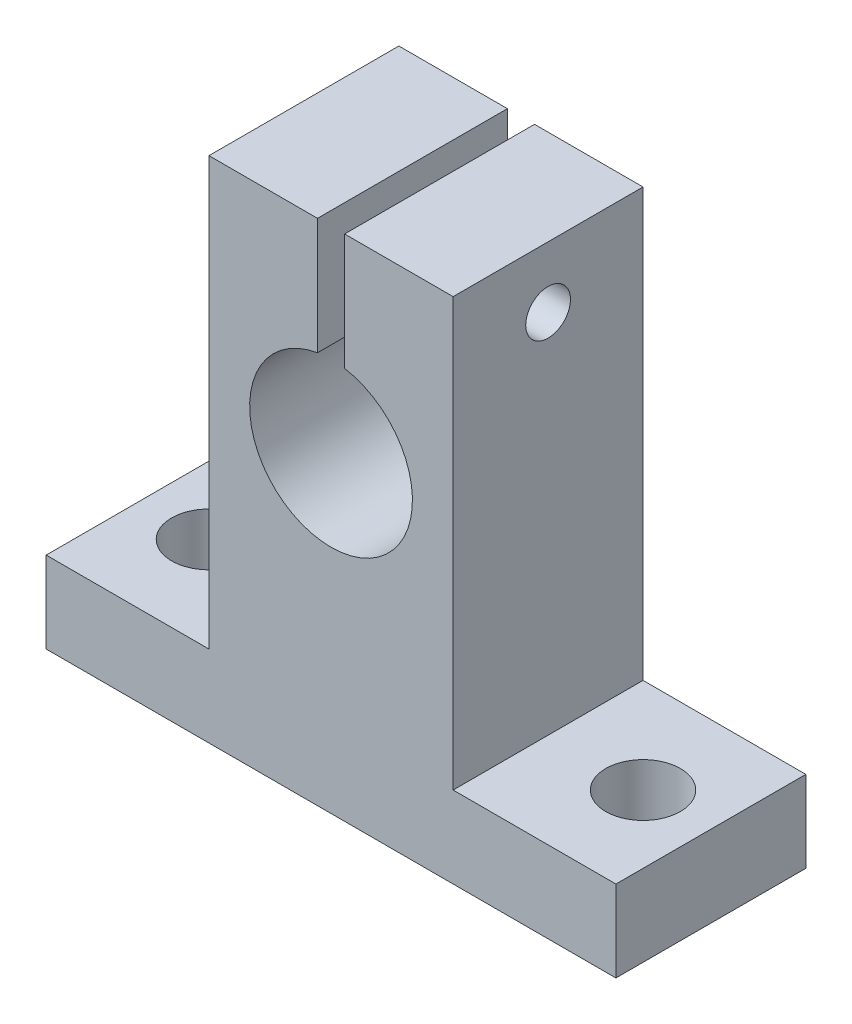
ISO-10303-21;
HEADER;
FILE_DESCRIPTION(('STEP AP214'),'2;1');
FILE_NAME('part.step','',(''),(''),'','','');
FILE_SCHEMA(('AUTOMOTIVE_DESIGN { 1 0 10303 214 1 1 1 1 }'));
ENDSEC;
DATA;
#1=APPLICATION_CONTEXT('core data for automotive mechanical design processes');
#2=APPLICATION_PROTOCOL_DEFINITION('international standard','automotive_design',2000,#1);
#3=PRODUCT_CONTEXT('',#1,'mechanical');
#4=PRODUCT('Part','Part','',(#3));
#5=PRODUCT_RELATED_PRODUCT_CATEGORY('part','',(#4));
#6=PRODUCT_DEFINITION_FORMATION('','',#4);
#7=PRODUCT_DEFINITION_CONTEXT('part definition',#1,'design');
#8=PRODUCT_DEFINITION('design','',#6,#7);
#9=PRODUCT_DEFINITION_SHAPE('','',#8);
#10=(LENGTH_UNIT() NAMED_UNIT(*) SI_UNIT(.MILLI.,.METRE.));
#11=(NAMED_UNIT(*) PLANE_ANGLE_UNIT() SI_UNIT($,.RADIAN.));
#12=(NAMED_UNIT(*) SI_UNIT($,.STERADIAN.) SOLID_ANGLE_UNIT());
#13=UNCERTAINTY_MEASURE_WITH_UNIT(LENGTH_MEASURE(1.E-05),#10,'distance_accuracy_value','');
#14=(GEOMETRIC_REPRESENTATION_CONTEXT(3) GLOBAL_UNCERTAINTY_ASSIGNED_CONTEXT((#13)) GLOBAL_UNIT_ASSIGNED_CONTEXT((#10,
#11,#12)) REPRESENTATION_CONTEXT('',''));
#15=CARTESIAN_POINT('',(0.,0.,0.));
#16=DIRECTION('',(0.,0.,1.));
#17=DIRECTION('',(1.,0.,0.));
#18=AXIS2_PLACEMENT_3D('',#15,#16,#17);
#19=CARTESIAN_POINT('',(0.,0.,14.));
#20=DIRECTION('',(0.,0.,1.));
#21=DIRECTION('',(1.,0.,0.));
#22=AXIS2_PLACEMENT_3D('',#19,#20,#21);
#23=PLANE('',#22);
#24=DIRECTION('',(0.,1.,0.));
#25=VECTOR('',#24,1.);
#26=CARTESIAN_POINT('',(1.,0.,14.));
#27=LINE('',#26,#25);
#28=CARTESIAN_POINT('',(1.,5.91607978309962,14.));
#29=VERTEX_POINT('',#28);
#30=CARTESIAN_POINT('',(1.,14.5,14.));
#31=VERTEX_POINT('',#30);
#32=EDGE_CURVE('E179',#29,#31,#27,.T.);
#33=ORIENTED_EDGE('',*,*,#32,.F.);
#34=CARTESIAN_POINT('',(0.,0.,14.));
#35=DIRECTION('',(0.,0.,-1.));
#36=DIRECTION('',(-1.,0.,0.));
#37=AXIS2_PLACEMENT_3D('',#34,#35,#36);
#38=CIRCLE('',#37,6.);
#39=CARTESIAN_POINT('',(-1.,5.91607978309961,14.));
#40=VERTEX_POINT('',#39);
#41=EDGE_CURVE('E52',#29,#40,#38,.T.);
#42=ORIENTED_EDGE('',*,*,#41,.T.);
#43=DIRECTION('',(0.,1.,0.));
#44=VECTOR('',#43,1.);
#45=CARTESIAN_POINT('',(-1.,0.,14.));
#46=LINE('',#45,#44);
#47=CARTESIAN_POINT('',(-1.,14.5,14.));
#48=VERTEX_POINT('',#47);
#49=EDGE_CURVE('E92',#40,#48,#46,.T.);
#50=ORIENTED_EDGE('',*,*,#49,.T.);
#51=DIRECTION('',(-1.,0.,0.));
#52=VECTOR('',#51,1.);
#53=CARTESIAN_POINT('',(-1.,14.5,14.));
#54=LINE('',#53,#52);
#55=CARTESIAN_POINT('',(-9.,14.5,14.));
#56=VERTEX_POINT('',#55);
#57=EDGE_CURVE('E107',#48,#56,#54,.T.);
#58=ORIENTED_EDGE('',*,*,#57,.T.);
#59=DIRECTION('',(0.,-1.,0.));
#60=VECTOR('',#59,1.);
#61=CARTESIAN_POINT('',(-9.,14.5,14.));
#62=LINE('',#61,#60);
#63=CARTESIAN_POINT('',(-8.99999999999999,-17.,14.));
#64=VERTEX_POINT('',#63);
#65=EDGE_CURVE('E100',#56,#64,#62,.T.);
#66=ORIENTED_EDGE('',*,*,#65,.T.);
#67=DIRECTION('',(-1.,0.,0.));
#68=VECTOR('',#67,1.);
#69=CARTESIAN_POINT('',(-8.99999999999999,-17.,14.));
#70=LINE('',#69,#68);
#71=CARTESIAN_POINT('',(-21.,-17.,14.));
#72=VERTEX_POINT('',#71);
#73=EDGE_CURVE('E104',#64,#72,#70,.T.);
#74=ORIENTED_EDGE('',*,*,#73,.T.);
#75=DIRECTION('',(0.,-1.,0.));
#76=VECTOR('',#75,1.);
#77=CARTESIAN_POINT('',(-21.,-17.,14.));
#78=LINE('',#77,#76);
#79=CARTESIAN_POINT('',(-21.,-23.,14.));
#80=VERTEX_POINT('',#79);
#81=EDGE_CURVE('E61',#72,#80,#78,.T.);
#82=ORIENTED_EDGE('',*,*,#81,.T.);
#83=DIRECTION('',(1.,0.,0.));
#84=VECTOR('',#83,1.);
#85=CARTESIAN_POINT('',(-21.,-23.,14.));
#86=LINE('',#85,#84);
#87=CARTESIAN_POINT('',(21.,-23.,14.));
#88=VERTEX_POINT('',#87);
#89=EDGE_CURVE('E140',#80,#88,#86,.T.);
#90=ORIENTED_EDGE('',*,*,#89,.T.);
#91=DIRECTION('',(0.,-1.,0.));
#92=VECTOR('',#91,1.);
#93=CARTESIAN_POINT('',(21.,-17.,14.));
#94=LINE('',#93,#92);
#95=CARTESIAN_POINT('',(21.,-17.,14.));
#96=VERTEX_POINT('',#95);
#97=EDGE_CURVE('E166',#96,#88,#94,.T.);
#98=ORIENTED_EDGE('',*,*,#97,.F.);
#99=DIRECTION('',(1.,0.,0.));
#100=VECTOR('',#99,1.);
#101=CARTESIAN_POINT('',(8.99999999999999,-17.,14.));
#102=LINE('',#101,#100);
#103=CARTESIAN_POINT('',(8.99999999999999,-17.,14.));
#104=VERTEX_POINT('',#103);
#105=EDGE_CURVE('E169',#104,#96,#102,.T.);
#106=ORIENTED_EDGE('',*,*,#105,.F.);
#107=DIRECTION('',(0.,-1.,0.));
#108=VECTOR('',#107,1.);
#109=CARTESIAN_POINT('',(9.,14.5,14.));
#110=LINE('',#109,#108);
#111=CARTESIAN_POINT('',(9.,14.5,14.));
#112=VERTEX_POINT('',#111);
#113=EDGE_CURVE('E173',#112,#104,#110,.T.);
#114=ORIENTED_EDGE('',*,*,#113,.F.);
#115=DIRECTION('',(1.,0.,0.));
#116=VECTOR('',#115,1.);
#117=CARTESIAN_POINT('',(1.,14.5,14.));
#118=LINE('',#117,#116);
#119=EDGE_CURVE('E176',#31,#112,#118,.T.);
#120=ORIENTED_EDGE('',*,*,#119,.F.);
#121=EDGE_LOOP('',(#33,#42,#50,#58,#66,#74,#82,#90,#98,#106,#114,#120));
#122=FACE_BOUND('',#121,.T.);
#123=ADVANCED_FACE('F38',(#122),#23,.T.);
#124=CARTESIAN_POINT('',(0.,0.,0.));
#125=DIRECTION('',(0.,0.,1.));
#126=DIRECTION('',(1.,0.,0.));
#127=AXIS2_PLACEMENT_3D('',#124,#125,#126);
#128=PLANE('',#127);
#129=CARTESIAN_POINT('',(0.,0.,0.));
#130=DIRECTION('',(0.,0.,-1.));
#131=DIRECTION('',(-1.,0.,0.));
#132=AXIS2_PLACEMENT_3D('',#129,#130,#131);
#133=CIRCLE('',#132,6.);
#134=CARTESIAN_POINT('',(1.,5.91607978309962,0.));
#135=VERTEX_POINT('',#134);
#136=CARTESIAN_POINT('',(-1.,5.91607978309962,0.));
#137=VERTEX_POINT('',#136);
#138=EDGE_CURVE('E248',#135,#137,#133,.T.);
#139=ORIENTED_EDGE('',*,*,#138,.F.);
#140=DIRECTION('',(0.,1.,0.));
#141=VECTOR('',#140,1.);
#142=CARTESIAN_POINT('',(1.,0.,0.));
#143=LINE('',#142,#141);
#144=CARTESIAN_POINT('',(1.,14.5,0.));
#145=VERTEX_POINT('',#144);
#146=EDGE_CURVE('E170',#135,#145,#143,.T.);
#147=ORIENTED_EDGE('',*,*,#146,.T.);
#148=DIRECTION('',(1.,0.,0.));
#149=VECTOR('',#148,1.);
#150=CARTESIAN_POINT('',(1.,14.5,0.));
#151=LINE('',#150,#149);
#152=CARTESIAN_POINT('',(9.,14.5,0.));
#153=VERTEX_POINT('',#152);
#154=EDGE_CURVE('E191',#145,#153,#151,.T.);
#155=ORIENTED_EDGE('',*,*,#154,.T.);
#156=DIRECTION('',(0.,-1.,0.));
#157=VECTOR('',#156,1.);
#158=CARTESIAN_POINT('',(9.,14.5,0.));
#159=LINE('',#158,#157);
#160=CARTESIAN_POINT('',(8.99999999999999,-17.,0.));
#161=VERTEX_POINT('',#160);
#162=EDGE_CURVE('E188',#153,#161,#159,.T.);
#163=ORIENTED_EDGE('',*,*,#162,.T.);
#164=DIRECTION('',(1.,0.,0.));
#165=VECTOR('',#164,1.);
#166=CARTESIAN_POINT('',(8.99999999999999,-17.,0.));
#167=LINE('',#166,#165);
#168=CARTESIAN_POINT('',(21.,-17.,0.));
#169=VERTEX_POINT('',#168);
#170=EDGE_CURVE('E185',#161,#169,#167,.T.);
#171=ORIENTED_EDGE('',*,*,#170,.T.);
#172=DIRECTION('',(0.,-1.,0.));
#173=VECTOR('',#172,1.);
#174=CARTESIAN_POINT('',(21.,-17.,0.));
#175=LINE('',#174,#173);
#176=CARTESIAN_POINT('',(21.,-23.,0.));
#177=VERTEX_POINT('',#176);
#178=EDGE_CURVE('E165',#169,#177,#175,.T.);
#179=ORIENTED_EDGE('',*,*,#178,.T.);
#180=DIRECTION('',(1.,0.,0.));
#181=VECTOR('',#180,1.);
#182=CARTESIAN_POINT('',(-21.,-23.,0.));
#183=LINE('',#182,#181);
#184=CARTESIAN_POINT('',(-21.,-23.,0.));
#185=VERTEX_POINT('',#184);
#186=EDGE_CURVE('E128',#185,#177,#183,.T.);
#187=ORIENTED_EDGE('',*,*,#186,.F.);
#188=DIRECTION('',(0.,-1.,0.));
#189=VECTOR('',#188,1.);
#190=CARTESIAN_POINT('',(-21.,-17.,0.));
#191=LINE('',#190,#189);
#192=CARTESIAN_POINT('',(-21.,-17.,0.));
#193=VERTEX_POINT('',#192);
#194=EDGE_CURVE('E85',#193,#185,#191,.T.);
#195=ORIENTED_EDGE('',*,*,#194,.F.);
#196=DIRECTION('',(-1.,0.,0.));
#197=VECTOR('',#196,1.);
#198=CARTESIAN_POINT('',(-8.99999999999999,-17.,0.));
#199=LINE('',#198,#197);
#200=CARTESIAN_POINT('',(-8.99999999999999,-17.,0.));
#201=VERTEX_POINT('',#200);
#202=EDGE_CURVE('E137',#201,#193,#199,.T.);
#203=ORIENTED_EDGE('',*,*,#202,.F.);
#204=DIRECTION('',(0.,-1.,0.));
#205=VECTOR('',#204,1.);
#206=CARTESIAN_POINT('',(-9.,14.5,0.));
#207=LINE('',#206,#205);
#208=CARTESIAN_POINT('',(-9.,14.5,0.));
#209=VERTEX_POINT('',#208);
#210=EDGE_CURVE('E116',#209,#201,#207,.T.);
#211=ORIENTED_EDGE('',*,*,#210,.F.);
#212=DIRECTION('',(-1.,0.,0.));
#213=VECTOR('',#212,1.);
#214=CARTESIAN_POINT('',(-1.,14.5,0.));
#215=LINE('',#214,#213);
#216=CARTESIAN_POINT('',(-1.,14.5,0.));
#217=VERTEX_POINT('',#216);
#218=EDGE_CURVE('E134',#217,#209,#215,.T.);
#219=ORIENTED_EDGE('',*,*,#218,.F.);
#220=DIRECTION('',(0.,1.,0.));
#221=VECTOR('',#220,1.);
#222=CARTESIAN_POINT('',(-1.,0.,0.));
#223=LINE('',#222,#221);
#224=EDGE_CURVE('E131',#137,#217,#223,.T.);
#225=ORIENTED_EDGE('',*,*,#224,.F.);
#226=EDGE_LOOP('',(#139,#147,#155,#163,#171,#179,#187,#195,#203,#211,#219,#225));
#227=FACE_BOUND('',#226,.T.);
#228=ADVANCED_FACE('F245',(#227),#128,.F.);
#229=CARTESIAN_POINT('',(-21.,-23.,14.));
#230=DIRECTION('',(0.,1.,0.));
#231=DIRECTION('',(0.,0.,1.));
#232=AXIS2_PLACEMENT_3D('',#229,#230,#231);
#233=PLANE('',#232);
#234=CARTESIAN_POINT('',(16.,-23.,7.));
#235=DIRECTION('',(0.,-1.,0.));
#236=DIRECTION('',(0.,0.,-1.));
#237=AXIS2_PLACEMENT_3D('',#234,#235,#236);
#238=CIRCLE('',#237,2.75);
#239=CARTESIAN_POINT('',(16.,-23.,4.25000000000001));
#240=VERTEX_POINT('',#239);
#241=EDGE_CURVE('E319',#240,#240,#238,.T.);
#242=ORIENTED_EDGE('',*,*,#241,.F.);
#243=EDGE_LOOP('',(#242));
#244=FACE_BOUND('',#243,.T.);
#245=CARTESIAN_POINT('',(-16.,-23.,7.));
#246=DIRECTION('',(0.,-1.,0.));
#247=DIRECTION('',(0.,0.,-1.));
#248=AXIS2_PLACEMENT_3D('',#245,#246,#247);
#249=CIRCLE('',#248,2.74999999999999);
#250=CARTESIAN_POINT('',(-16.,-23.,4.25000000000001));
#251=VERTEX_POINT('',#250);
#252=EDGE_CURVE('E313',#251,#251,#249,.T.);
#253=ORIENTED_EDGE('',*,*,#252,.F.);
#254=EDGE_LOOP('',(#253));
#255=FACE_BOUND('',#254,.T.);
#256=ORIENTED_EDGE('',*,*,#186,.T.);
#257=DIRECTION('',(0.,0.,-1.));
#258=VECTOR('',#257,1.);
#259=CARTESIAN_POINT('',(21.,-23.,14.));
#260=LINE('',#259,#258);
#261=EDGE_CURVE('E132',#88,#177,#260,.T.);
#262=ORIENTED_EDGE('',*,*,#261,.F.);
#263=ORIENTED_EDGE('',*,*,#89,.F.);
#264=DIRECTION('',(0.,0.,-1.));
#265=VECTOR('',#264,1.);
#266=CARTESIAN_POINT('',(-21.,-23.,14.));
#267=LINE('',#266,#265);
#268=EDGE_CURVE('E124',#80,#185,#267,.T.);
#269=ORIENTED_EDGE('',*,*,#268,.T.);
#270=EDGE_LOOP('',(#256,#262,#263,#269));
#271=FACE_BOUND('',#270,.T.);
#272=ADVANCED_FACE('F40',(#244,#255,#271),#233,.F.);
#273=CARTESIAN_POINT('',(-1.,0.,14.));
#274=DIRECTION('',(-1.,0.,0.));
#275=DIRECTION('',(0.,0.,1.));
#276=AXIS2_PLACEMENT_3D('',#273,#274,#275);
#277=PLANE('',#276);
#278=CARTESIAN_POINT('',(-1.,10.,7.));
#279=DIRECTION('',(-1.,0.,0.));
#280=DIRECTION('',(0.,0.,1.));
#281=AXIS2_PLACEMENT_3D('',#278,#279,#280);
#282=CIRCLE('',#281,1.64999999999999);
#283=CARTESIAN_POINT('',(-1.,10.,8.64999999999999));
#284=VERTEX_POINT('',#283);
#285=EDGE_CURVE('E152',#284,#284,#282,.T.);
#286=ORIENTED_EDGE('',*,*,#285,.T.);
#287=EDGE_LOOP('',(#286));
#288=FACE_BOUND('',#287,.T.);
#289=ORIENTED_EDGE('',*,*,#49,.F.);
#290=DIRECTION('',(0.,0.,-1.));
#291=VECTOR('',#290,1.);
#292=CARTESIAN_POINT('',(-1.,5.91607978309962,0.));
#293=LINE('',#292,#291);
#294=EDGE_CURVE('E155',#40,#137,#293,.T.);
#295=ORIENTED_EDGE('',*,*,#294,.T.);
#296=ORIENTED_EDGE('',*,*,#224,.T.);
#297=DIRECTION('',(0.,0.,-1.));
#298=VECTOR('',#297,1.);
#299=CARTESIAN_POINT('',(-1.,14.5,14.));
#300=LINE('',#299,#298);
#301=EDGE_CURVE('E46',#48,#217,#300,.T.);
#302=ORIENTED_EDGE('',*,*,#301,.F.);
#303=EDGE_LOOP('',(#289,#295,#296,#302));
#304=FACE_BOUND('',#303,.T.);
#305=ADVANCED_FACE('F288',(#288,#304),#277,.F.);
#306=CARTESIAN_POINT('',(-1.,14.5,14.));
#307=DIRECTION('',(0.,-1.,0.));
#308=DIRECTION('',(1.,0.,0.));
#309=AXIS2_PLACEMENT_3D('',#306,#307,#308);
#310=PLANE('',#309);
#311=ORIENTED_EDGE('',*,*,#218,.T.);
#312=DIRECTION('',(0.,0.,-1.));
#313=VECTOR('',#312,1.);
#314=CARTESIAN_POINT('',(-9.,14.5,14.));
#315=LINE('',#314,#313);
#316=EDGE_CURVE('E119',#56,#209,#315,.T.);
#317=ORIENTED_EDGE('',*,*,#316,.F.);
#318=ORIENTED_EDGE('',*,*,#57,.F.);
#319=ORIENTED_EDGE('',*,*,#301,.T.);
#320=EDGE_LOOP('',(#311,#317,#318,#319));
#321=FACE_BOUND('',#320,.T.);
#322=ADVANCED_FACE('F285',(#321),#310,.F.);
#323=CARTESIAN_POINT('',(-9.,14.5,14.));
#324=DIRECTION('',(1.,0.,0.));
#325=DIRECTION('',(0.,1.,0.));
#326=AXIS2_PLACEMENT_3D('',#323,#324,#325);
#327=PLANE('',#326);
#328=CARTESIAN_POINT('',(-9.,10.,7.));
#329=DIRECTION('',(-1.,0.,0.));
#330=DIRECTION('',(0.,0.,1.));
#331=AXIS2_PLACEMENT_3D('',#328,#329,#330);
#332=CIRCLE('',#331,1.64999999999999);
#333=CARTESIAN_POINT('',(-9.,10.,8.64999999999999));
#334=VERTEX_POINT('',#333);
#335=EDGE_CURVE('E148',#334,#334,#332,.T.);
#336=ORIENTED_EDGE('',*,*,#335,.F.);
#337=EDGE_LOOP('',(#336));
#338=FACE_BOUND('',#337,.T.);
#339=ORIENTED_EDGE('',*,*,#210,.T.);
#340=DIRECTION('',(0.,0.,-1.));
#341=VECTOR('',#340,1.);
#342=CARTESIAN_POINT('',(-8.99999999999999,-17.,14.));
#343=LINE('',#342,#341);
#344=EDGE_CURVE('E113',#64,#201,#343,.T.);
#345=ORIENTED_EDGE('',*,*,#344,.F.);
#346=ORIENTED_EDGE('',*,*,#65,.F.);
#347=ORIENTED_EDGE('',*,*,#316,.T.);
#348=EDGE_LOOP('',(#339,#345,#346,#347));
#349=FACE_BOUND('',#348,.T.);
#350=ADVANCED_FACE('F114',(#338,#349),#327,.F.);
#351=CARTESIAN_POINT('',(-8.99999999999999,-17.,14.));
#352=DIRECTION('',(0.,-1.,0.));
#353=DIRECTION('',(0.,0.,-1.));
#354=AXIS2_PLACEMENT_3D('',#351,#352,#353);
#355=PLANE('',#354);
#356=CARTESIAN_POINT('',(-16.,-17.,7.));
#357=DIRECTION('',(0.,-1.,0.));
#358=DIRECTION('',(0.,0.,-1.));
#359=AXIS2_PLACEMENT_3D('',#356,#357,#358);
#360=CIRCLE('',#359,2.74999999999999);
#361=CARTESIAN_POINT('',(-16.,-17.,4.25000000000001));
#362=VERTEX_POINT('',#361);
#363=EDGE_CURVE('E308',#362,#362,#360,.T.);
#364=ORIENTED_EDGE('',*,*,#363,.T.);
#365=EDGE_LOOP('',(#364));
#366=FACE_BOUND('',#365,.T.);
#367=ORIENTED_EDGE('',*,*,#202,.T.);
#368=DIRECTION('',(0.,0.,-1.));
#369=VECTOR('',#368,1.);
#370=CARTESIAN_POINT('',(-21.,-17.,14.));
#371=LINE('',#370,#369);
#372=EDGE_CURVE('E120',#72,#193,#371,.T.);
#373=ORIENTED_EDGE('',*,*,#372,.F.);
#374=ORIENTED_EDGE('',*,*,#73,.F.);
#375=ORIENTED_EDGE('',*,*,#344,.T.);
#376=EDGE_LOOP('',(#367,#373,#374,#375));
#377=FACE_BOUND('',#376,.T.);
#378=ADVANCED_FACE('F122',(#366,#377),#355,.F.);
#379=CARTESIAN_POINT('',(-21.,-17.,14.));
#380=DIRECTION('',(1.,0.,0.));
#381=DIRECTION('',(0.,0.,-1.));
#382=AXIS2_PLACEMENT_3D('',#379,#380,#381);
#383=PLANE('',#382);
#384=ORIENTED_EDGE('',*,*,#194,.T.);
#385=ORIENTED_EDGE('',*,*,#268,.F.);
#386=ORIENTED_EDGE('',*,*,#81,.F.);
#387=ORIENTED_EDGE('',*,*,#372,.T.);
#388=EDGE_LOOP('',(#384,#385,#386,#387));
#389=FACE_BOUND('',#388,.T.);
#390=ADVANCED_FACE('F278',(#389),#383,.F.);
#391=CARTESIAN_POINT('',(21.,-17.,14.));
#392=DIRECTION('',(1.,0.,0.));
#393=DIRECTION('',(0.,0.,-1.));
#394=AXIS2_PLACEMENT_3D('',#391,#392,#393);
#395=PLANE('',#394);
#396=ORIENTED_EDGE('',*,*,#178,.F.);
#397=DIRECTION('',(0.,0.,-1.));
#398=VECTOR('',#397,1.);
#399=CARTESIAN_POINT('',(21.,-17.,14.));
#400=LINE('',#399,#398);
#401=EDGE_CURVE('E204',#96,#169,#400,.T.);
#402=ORIENTED_EDGE('',*,*,#401,.F.);
#403=ORIENTED_EDGE('',*,*,#97,.T.);
#404=ORIENTED_EDGE('',*,*,#261,.T.);
#405=EDGE_LOOP('',(#396,#402,#403,#404));
#406=FACE_BOUND('',#405,.T.);
#407=ADVANCED_FACE('F223',(#406),#395,.T.);
#408=CARTESIAN_POINT('',(8.99999999999999,-17.,14.));
#409=DIRECTION('',(0.,1.,0.));
#410=DIRECTION('',(0.,0.,1.));
#411=AXIS2_PLACEMENT_3D('',#408,#409,#410);
#412=PLANE('',#411);
#413=CARTESIAN_POINT('',(16.,-17.,7.));
#414=DIRECTION('',(0.,1.,0.));
#415=DIRECTION('',(0.,0.,1.));
#416=AXIS2_PLACEMENT_3D('',#413,#414,#415);
#417=CIRCLE('',#416,2.74999999999999);
#418=CARTESIAN_POINT('',(16.,-17.,9.74999999999999));
#419=VERTEX_POINT('',#418);
#420=EDGE_CURVE('E316',#419,#419,#417,.T.);
#421=ORIENTED_EDGE('',*,*,#420,.F.);
#422=EDGE_LOOP('',(#421));
#423=FACE_BOUND('',#422,.T.);
#424=ORIENTED_EDGE('',*,*,#170,.F.);
#425=DIRECTION('',(0.,0.,-1.));
#426=VECTOR('',#425,1.);
#427=CARTESIAN_POINT('',(8.99999999999999,-17.,14.));
#428=LINE('',#427,#426);
#429=EDGE_CURVE('E201',#104,#161,#428,.T.);
#430=ORIENTED_EDGE('',*,*,#429,.F.);
#431=ORIENTED_EDGE('',*,*,#105,.T.);
#432=ORIENTED_EDGE('',*,*,#401,.T.);
#433=EDGE_LOOP('',(#424,#430,#431,#432));
#434=FACE_BOUND('',#433,.T.);
#435=ADVANCED_FACE('F229',(#423,#434),#412,.T.);
#436=CARTESIAN_POINT('',(9.,14.5,14.));
#437=DIRECTION('',(1.,0.,0.));
#438=DIRECTION('',(0.,1.,0.));
#439=AXIS2_PLACEMENT_3D('',#436,#437,#438);
#440=PLANE('',#439);
#441=CARTESIAN_POINT('',(9.,10.,7.));
#442=DIRECTION('',(1.,0.,0.));
#443=DIRECTION('',(0.,1.,0.));
#444=AXIS2_PLACEMENT_3D('',#441,#442,#443);
#445=CIRCLE('',#444,1.64999999999999);
#446=CARTESIAN_POINT('',(9.,11.65,7.));
#447=VERTEX_POINT('',#446);
#448=EDGE_CURVE('E147',#447,#447,#445,.T.);
#449=ORIENTED_EDGE('',*,*,#448,.F.);
#450=EDGE_LOOP('',(#449));
#451=FACE_BOUND('',#450,.T.);
#452=ORIENTED_EDGE('',*,*,#162,.F.);
#453=DIRECTION('',(0.,0.,-1.));
#454=VECTOR('',#453,1.);
#455=CARTESIAN_POINT('',(9.,14.5,14.));
#456=LINE('',#455,#454);
#457=EDGE_CURVE('E198',#112,#153,#456,.T.);
#458=ORIENTED_EDGE('',*,*,#457,.F.);
#459=ORIENTED_EDGE('',*,*,#113,.T.);
#460=ORIENTED_EDGE('',*,*,#429,.T.);
#461=EDGE_LOOP('',(#452,#458,#459,#460));
#462=FACE_BOUND('',#461,.T.);
#463=ADVANCED_FACE('F256',(#451,#462),#440,.T.);
#464=CARTESIAN_POINT('',(1.,14.5,14.));
#465=DIRECTION('',(0.,1.,0.));
#466=DIRECTION('',(-1.,0.,0.));
#467=AXIS2_PLACEMENT_3D('',#464,#465,#466);
#468=PLANE('',#467);
#469=ORIENTED_EDGE('',*,*,#154,.F.);
#470=DIRECTION('',(0.,0.,-1.));
#471=VECTOR('',#470,1.);
#472=CARTESIAN_POINT('',(1.,14.5,14.));
#473=LINE('',#472,#471);
#474=EDGE_CURVE('E182',#31,#145,#473,.T.);
#475=ORIENTED_EDGE('',*,*,#474,.F.);
#476=ORIENTED_EDGE('',*,*,#119,.T.);
#477=ORIENTED_EDGE('',*,*,#457,.T.);
#478=EDGE_LOOP('',(#469,#475,#476,#477));
#479=FACE_BOUND('',#478,.T.);
#480=ADVANCED_FACE('F254',(#479),#468,.T.);
#481=CARTESIAN_POINT('',(1.,0.,14.));
#482=DIRECTION('',(-1.,0.,0.));
#483=DIRECTION('',(0.,0.,1.));
#484=AXIS2_PLACEMENT_3D('',#481,#482,#483);
#485=PLANE('',#484);
#486=DIRECTION('',(0.,0.,-1.));
#487=VECTOR('',#486,1.);
#488=CARTESIAN_POINT('',(1.,5.91607978309962,0.));
#489=LINE('',#488,#487);
#490=EDGE_CURVE('E11',#29,#135,#489,.T.);
#491=ORIENTED_EDGE('',*,*,#490,.F.);
#492=ORIENTED_EDGE('',*,*,#32,.T.);
#493=ORIENTED_EDGE('',*,*,#474,.T.);
#494=ORIENTED_EDGE('',*,*,#146,.F.);
#495=EDGE_LOOP('',(#491,#492,#493,#494));
#496=FACE_BOUND('',#495,.T.);
#497=CARTESIAN_POINT('',(1.,10.,7.));
#498=DIRECTION('',(-1.,0.,0.));
#499=DIRECTION('',(0.,0.,1.));
#500=AXIS2_PLACEMENT_3D('',#497,#498,#499);
#501=CIRCLE('',#500,1.64999999999999);
#502=CARTESIAN_POINT('',(1.,10.,8.64999999999999));
#503=VERTEX_POINT('',#502);
#504=EDGE_CURVE('E145',#503,#503,#501,.T.);
#505=ORIENTED_EDGE('',*,*,#504,.F.);
#506=EDGE_LOOP('',(#505));
#507=FACE_BOUND('',#506,.T.);
#508=ADVANCED_FACE('F251',(#496,#507),#485,.T.);
#509=CARTESIAN_POINT('',(-9.,10.,7.));
#510=DIRECTION('',(-1.,0.,0.));
#511=DIRECTION('',(0.,0.,1.));
#512=AXIS2_PLACEMENT_3D('',#509,#510,#511);
#513=CYLINDRICAL_SURFACE('',#512,1.64999999999999);
#514=ORIENTED_EDGE('',*,*,#448,.T.);
#515=EDGE_LOOP('',(#514));
#516=FACE_BOUND('',#515,.T.);
#517=ORIENTED_EDGE('',*,*,#504,.T.);
#518=EDGE_LOOP('',(#517));
#519=FACE_BOUND('',#518,.T.);
#520=ADVANCED_FACE('F263',(#516,#519),#513,.F.);
#521=ORIENTED_EDGE('',*,*,#335,.T.);
#522=EDGE_LOOP('',(#521));
#523=FACE_BOUND('',#522,.T.);
#524=ORIENTED_EDGE('',*,*,#285,.F.);
#525=EDGE_LOOP('',(#524));
#526=FACE_BOUND('',#525,.T.);
#527=ADVANCED_FACE('F340',(#523,#526),#513,.F.);
#528=CARTESIAN_POINT('',(0.,0.,0.));
#529=DIRECTION('',(0.,0.,-1.));
#530=DIRECTION('',(-1.,0.,0.));
#531=AXIS2_PLACEMENT_3D('',#528,#529,#530);
#532=CYLINDRICAL_SURFACE('',#531,6.);
#533=ORIENTED_EDGE('',*,*,#41,.F.);
#534=ORIENTED_EDGE('',*,*,#490,.T.);
#535=ORIENTED_EDGE('',*,*,#138,.T.);
#536=ORIENTED_EDGE('',*,*,#294,.F.);
#537=EDGE_LOOP('',(#533,#534,#535,#536));
#538=FACE_BOUND('',#537,.T.);
#539=ADVANCED_FACE('F330',(#538),#532,.F.);
#540=CARTESIAN_POINT('',(-16.,-23.,7.));
#541=DIRECTION('',(0.,-1.,0.));
#542=DIRECTION('',(0.,0.,-1.));
#543=AXIS2_PLACEMENT_3D('',#540,#541,#542);
#544=CYLINDRICAL_SURFACE('',#543,2.74999999999999);
#545=ORIENTED_EDGE('',*,*,#252,.T.);
#546=EDGE_LOOP('',(#545));
#547=FACE_BOUND('',#546,.T.);
#548=ORIENTED_EDGE('',*,*,#363,.F.);
#549=EDGE_LOOP('',(#548));
#550=FACE_BOUND('',#549,.T.);
#551=ADVANCED_FACE('F327',(#547,#550),#544,.F.);
#552=CARTESIAN_POINT('',(16.,-23.,7.));
#553=DIRECTION('',(0.,-1.,0.));
#554=DIRECTION('',(0.,0.,-1.));
#555=AXIS2_PLACEMENT_3D('',#552,#553,#554);
#556=CYLINDRICAL_SURFACE('',#555,2.74999999999999);
#557=ORIENTED_EDGE('',*,*,#420,.T.);
#558=EDGE_LOOP('',(#557));
#559=FACE_BOUND('',#558,.T.);
#560=ORIENTED_EDGE('',*,*,#241,.T.);
#561=EDGE_LOOP('',(#560));
#562=FACE_BOUND('',#561,.T.);
#563=ADVANCED_FACE('F323',(#559,#562),#556,.F.);
#564=CLOSED_SHELL('',(#123,#228,#272,#305,#322,#350,#378,#390,#407,#435,#463,#480,#508,#520,
#527,#539,#551,#563));
#565=MANIFOLD_SOLID_BREP('B2',#564);
#566=ADVANCED_BREP_SHAPE_REPRESENTATION('',(#18,#565),#14);
#567=SHAPE_DEFINITION_REPRESENTATION(#9,#566);
ENDSEC;
END-ISO-10303-21;
